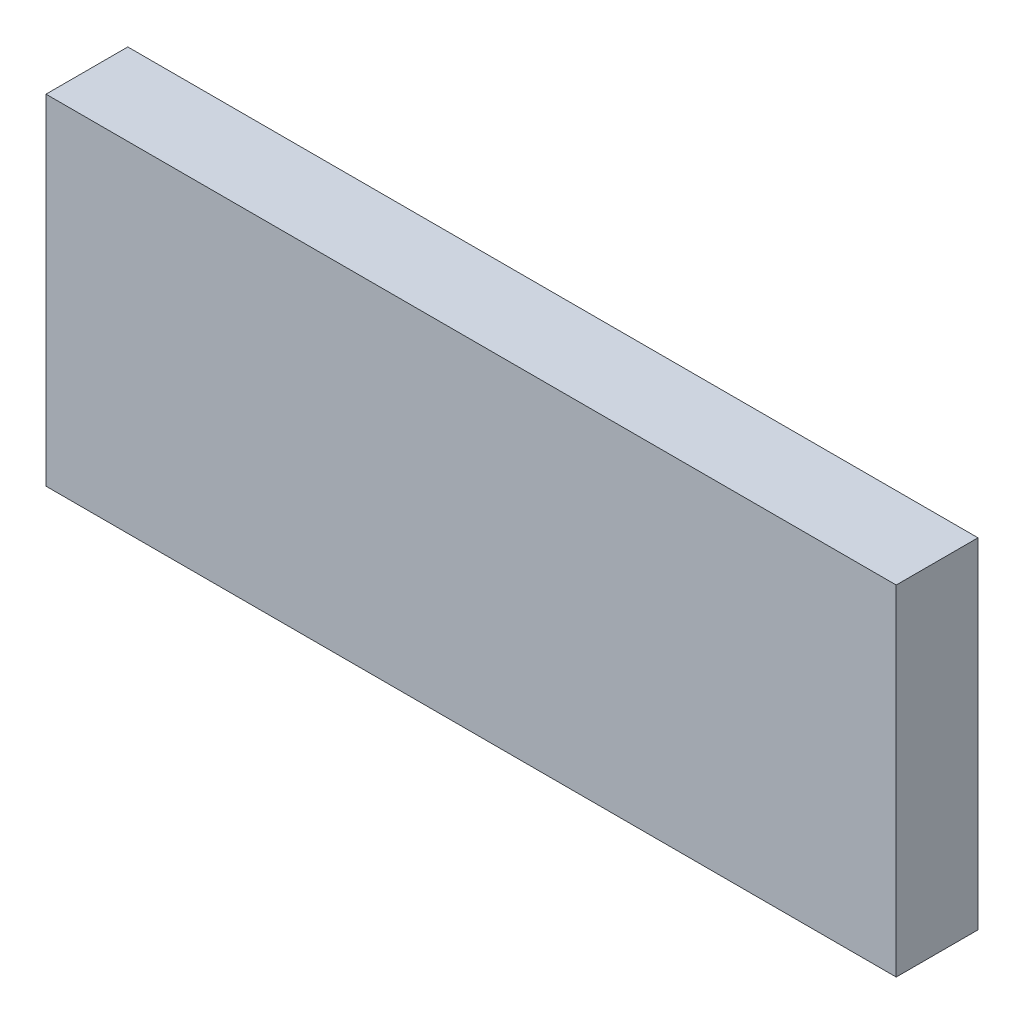
ISO-10303-21;
HEADER;
FILE_DESCRIPTION(('STEP AP214'),'2;1');
FILE_NAME('part.step','',(''),(''),'','','');
FILE_SCHEMA(('AUTOMOTIVE_DESIGN { 1 0 10303 214 1 1 1 1 }'));
ENDSEC;
DATA;
#1=APPLICATION_CONTEXT('core data for automotive mechanical design processes');
#2=APPLICATION_PROTOCOL_DEFINITION('international standard','automotive_design',2000,#1);
#3=PRODUCT_CONTEXT('',#1,'mechanical');
#4=PRODUCT('Part','Part','',(#3));
#5=PRODUCT_RELATED_PRODUCT_CATEGORY('part','',(#4));
#6=PRODUCT_DEFINITION_FORMATION('','',#4);
#7=PRODUCT_DEFINITION_CONTEXT('part definition',#1,'design');
#8=PRODUCT_DEFINITION('design','',#6,#7);
#9=PRODUCT_DEFINITION_SHAPE('','',#8);
#10=(LENGTH_UNIT() NAMED_UNIT(*) SI_UNIT(.MILLI.,.METRE.));
#11=(NAMED_UNIT(*) PLANE_ANGLE_UNIT() SI_UNIT($,.RADIAN.));
#12=(NAMED_UNIT(*) SI_UNIT($,.STERADIAN.) SOLID_ANGLE_UNIT());
#13=UNCERTAINTY_MEASURE_WITH_UNIT(LENGTH_MEASURE(1.E-05),#10,'distance_accuracy_value','');
#14=(GEOMETRIC_REPRESENTATION_CONTEXT(3) GLOBAL_UNCERTAINTY_ASSIGNED_CONTEXT((#13)) GLOBAL_UNIT_ASSIGNED_CONTEXT((#10,
#11,#12)) REPRESENTATION_CONTEXT('',''));
#15=CARTESIAN_POINT('',(0.,0.,0.));
#16=DIRECTION('',(0.,0.,1.));
#17=DIRECTION('',(1.,0.,0.));
#18=AXIS2_PLACEMENT_3D('',#15,#16,#17);
#19=CARTESIAN_POINT('',(0.,26.98242,0.));
#20=DIRECTION('',(1.,0.,0.));
#21=DIRECTION('',(0.,0.,-1.));
#22=AXIS2_PLACEMENT_3D('',#19,#20,#21);
#23=PLANE('',#22);
#24=DIRECTION('',(0.,0.,0.999999999999999));
#25=VECTOR('',#24,1.);
#26=CARTESIAN_POINT('',(0.,0.,0.));
#27=LINE('',#26,#25);
#28=CARTESIAN_POINT('',(0.,0.,0.));
#29=VERTEX_POINT('',#28);
#30=CARTESIAN_POINT('',(0.,0.,6.49985999999989));
#31=VERTEX_POINT('',#30);
#32=EDGE_CURVE('E106',#29,#31,#27,.T.);
#33=ORIENTED_EDGE('',*,*,#32,.T.);
#34=DIRECTION('',(0.,-1.,0.));
#35=VECTOR('',#34,1.);
#36=CARTESIAN_POINT('',(0.,26.98242,6.49985999999989));
#37=LINE('',#36,#35);
#38=CARTESIAN_POINT('',(0.,26.98242,6.49985999999989));
#39=VERTEX_POINT('',#38);
#40=EDGE_CURVE('E11',#39,#31,#37,.T.);
#41=ORIENTED_EDGE('',*,*,#40,.F.);
#42=DIRECTION('',(0.,0.,0.999999999999999));
#43=VECTOR('',#42,1.);
#44=CARTESIAN_POINT('',(0.,26.98242,0.));
#45=LINE('',#44,#43);
#46=CARTESIAN_POINT('',(0.,26.98242,0.));
#47=VERTEX_POINT('',#46);
#48=EDGE_CURVE('E89',#47,#39,#45,.T.);
#49=ORIENTED_EDGE('',*,*,#48,.F.);
#50=DIRECTION('',(0.,-1.,0.));
#51=VECTOR('',#50,1.);
#52=CARTESIAN_POINT('',(0.,26.98242,0.));
#53=LINE('',#52,#51);
#54=EDGE_CURVE('E102',#47,#29,#53,.T.);
#55=ORIENTED_EDGE('',*,*,#54,.T.);
#56=EDGE_LOOP('',(#33,#41,#49,#55));
#57=FACE_BOUND('',#56,.T.);
#58=ADVANCED_FACE('F37',(#57),#23,.F.);
#59=CARTESIAN_POINT('',(0.,26.98242,6.49985999999989));
#60=DIRECTION('',(0.,0.,-1.));
#61=DIRECTION('',(-1.,0.,0.));
#62=AXIS2_PLACEMENT_3D('',#59,#60,#61);
#63=PLANE('',#62);
#64=DIRECTION('',(1.,0.,0.));
#65=VECTOR('',#64,1.);
#66=CARTESIAN_POINT('',(0.,0.,6.49985999999989));
#67=LINE('',#66,#65);
#68=CARTESIAN_POINT('',(67.564,0.,6.49985999999994));
#69=VERTEX_POINT('',#68);
#70=EDGE_CURVE('E94',#31,#69,#67,.T.);
#71=ORIENTED_EDGE('',*,*,#70,.T.);
#72=DIRECTION('',(0.,-1.,0.));
#73=VECTOR('',#72,1.);
#74=CARTESIAN_POINT('',(67.564,26.98242,6.49985999999989));
#75=LINE('',#74,#73);
#76=CARTESIAN_POINT('',(67.564,26.98242,6.49985999999989));
#77=VERTEX_POINT('',#76);
#78=EDGE_CURVE('E46',#77,#69,#75,.T.);
#79=ORIENTED_EDGE('',*,*,#78,.F.);
#80=DIRECTION('',(1.,0.,0.));
#81=VECTOR('',#80,1.);
#82=CARTESIAN_POINT('',(0.,26.98242,6.49985999999989));
#83=LINE('',#82,#81);
#84=EDGE_CURVE('E84',#39,#77,#83,.T.);
#85=ORIENTED_EDGE('',*,*,#84,.F.);
#86=ORIENTED_EDGE('',*,*,#40,.T.);
#87=EDGE_LOOP('',(#71,#79,#85,#86));
#88=FACE_BOUND('',#87,.T.);
#89=ADVANCED_FACE('F93',(#88),#63,.F.);
#90=CARTESIAN_POINT('',(67.564,26.98242,0.));
#91=DIRECTION('',(-1.,0.,0.));
#92=DIRECTION('',(0.,0.,1.));
#93=AXIS2_PLACEMENT_3D('',#90,#91,#92);
#94=PLANE('',#93);
#95=DIRECTION('',(0.,0.,-0.999999999999999));
#96=VECTOR('',#95,1.);
#97=CARTESIAN_POINT('',(67.564,0.,0.));
#98=LINE('',#97,#96);
#99=CARTESIAN_POINT('',(67.564,0.,0.));
#100=VERTEX_POINT('',#99);
#101=EDGE_CURVE('E71',#69,#100,#98,.T.);
#102=ORIENTED_EDGE('',*,*,#101,.T.);
#103=DIRECTION('',(0.,-1.,0.));
#104=VECTOR('',#103,1.);
#105=CARTESIAN_POINT('',(67.564,26.98242,0.));
#106=LINE('',#105,#104);
#107=CARTESIAN_POINT('',(67.564,26.98242,0.));
#108=VERTEX_POINT('',#107);
#109=EDGE_CURVE('E96',#108,#100,#106,.T.);
#110=ORIENTED_EDGE('',*,*,#109,.F.);
#111=DIRECTION('',(0.,0.,-0.999999999999999));
#112=VECTOR('',#111,1.);
#113=CARTESIAN_POINT('',(67.564,26.98242,0.));
#114=LINE('',#113,#112);
#115=EDGE_CURVE('E87',#77,#108,#114,.T.);
#116=ORIENTED_EDGE('',*,*,#115,.F.);
#117=ORIENTED_EDGE('',*,*,#78,.T.);
#118=EDGE_LOOP('',(#102,#110,#116,#117));
#119=FACE_BOUND('',#118,.T.);
#120=ADVANCED_FACE('F97',(#119),#94,.F.);
#121=CARTESIAN_POINT('',(0.,26.98242,0.));
#122=DIRECTION('',(0.,0.,1.));
#123=DIRECTION('',(1.,0.,0.));
#124=AXIS2_PLACEMENT_3D('',#121,#122,#123);
#125=PLANE('',#124);
#126=DIRECTION('',(-1.,0.,0.));
#127=VECTOR('',#126,1.);
#128=CARTESIAN_POINT('',(0.,0.,0.));
#129=LINE('',#128,#127);
#130=EDGE_CURVE('E77',#100,#29,#129,.T.);
#131=ORIENTED_EDGE('',*,*,#130,.T.);
#132=ORIENTED_EDGE('',*,*,#54,.F.);
#133=DIRECTION('',(-1.,0.,0.));
#134=VECTOR('',#133,1.);
#135=CARTESIAN_POINT('',(0.,26.98242,0.));
#136=LINE('',#135,#134);
#137=EDGE_CURVE('E54',#108,#47,#136,.T.);
#138=ORIENTED_EDGE('',*,*,#137,.F.);
#139=ORIENTED_EDGE('',*,*,#109,.T.);
#140=EDGE_LOOP('',(#131,#132,#138,#139));
#141=FACE_BOUND('',#140,.T.);
#142=ADVANCED_FACE('F120',(#141),#125,.F.);
#143=CARTESIAN_POINT('',(0.,26.98242,0.));
#144=DIRECTION('',(0.,1.,0.));
#145=DIRECTION('',(0.,0.,1.));
#146=AXIS2_PLACEMENT_3D('',#143,#144,#145);
#147=PLANE('',#146);
#148=ORIENTED_EDGE('',*,*,#48,.T.);
#149=ORIENTED_EDGE('',*,*,#84,.T.);
#150=ORIENTED_EDGE('',*,*,#115,.T.);
#151=ORIENTED_EDGE('',*,*,#137,.T.);
#152=EDGE_LOOP('',(#148,#149,#150,#151));
#153=FACE_BOUND('',#152,.T.);
#154=ADVANCED_FACE('F85',(#153),#147,.T.);
#155=CARTESIAN_POINT('',(0.,0.,0.));
#156=DIRECTION('',(0.,1.,0.));
#157=DIRECTION('',(0.,0.,1.));
#158=AXIS2_PLACEMENT_3D('',#155,#156,#157);
#159=PLANE('',#158);
#160=ORIENTED_EDGE('',*,*,#32,.F.);
#161=ORIENTED_EDGE('',*,*,#130,.F.);
#162=ORIENTED_EDGE('',*,*,#101,.F.);
#163=ORIENTED_EDGE('',*,*,#70,.F.);
#164=EDGE_LOOP('',(#160,#161,#162,#163));
#165=FACE_BOUND('',#164,.T.);
#166=ADVANCED_FACE('F123',(#165),#159,.F.);
#167=CLOSED_SHELL('',(#58,#89,#120,#142,#154,#166));
#168=MANIFOLD_SOLID_BREP('B2',#167);
#169=ADVANCED_BREP_SHAPE_REPRESENTATION('',(#18,#168),#14);
#170=SHAPE_DEFINITION_REPRESENTATION(#9,#169);
ENDSEC;
END-ISO-10303-21;
